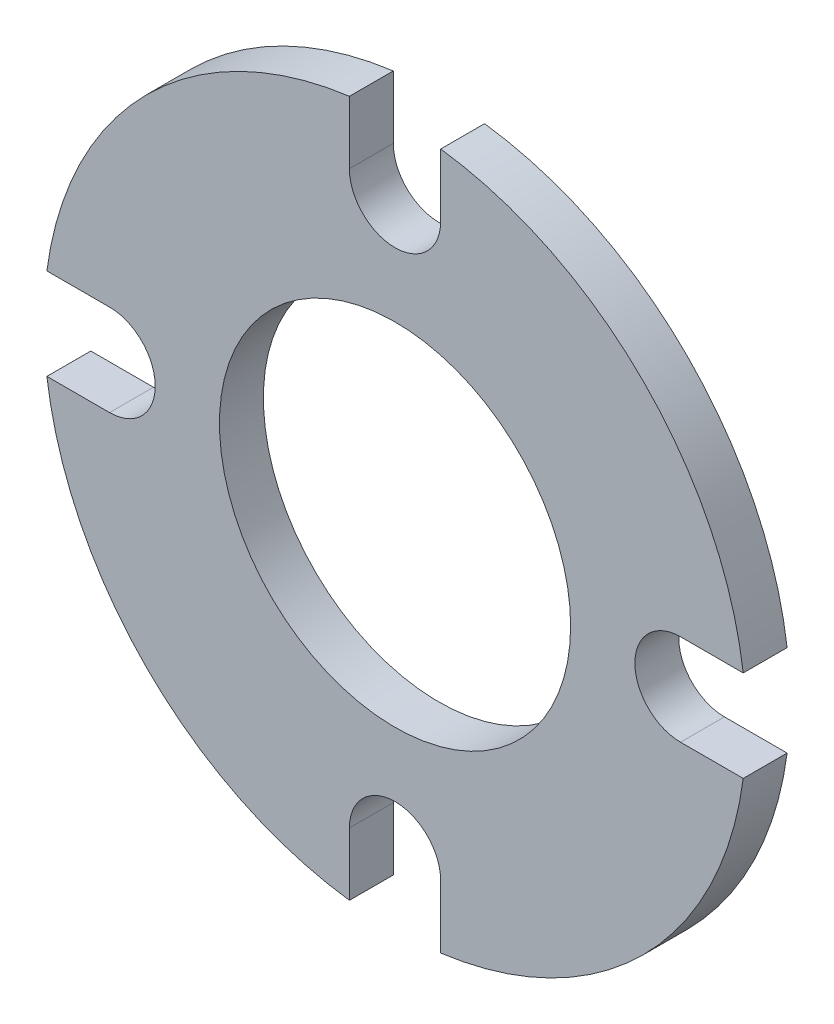
ISO-10303-21;
HEADER;
FILE_DESCRIPTION(('STEP AP214'),'2;1');
FILE_NAME('part.step','',(''),(''),'','','');
FILE_SCHEMA(('AUTOMOTIVE_DESIGN { 1 0 10303 214 1 1 1 1 }'));
ENDSEC;
DATA;
#1=APPLICATION_CONTEXT('core data for automotive mechanical design processes');
#2=APPLICATION_PROTOCOL_DEFINITION('international standard','automotive_design',2000,#1);
#3=PRODUCT_CONTEXT('',#1,'mechanical');
#4=PRODUCT('Part','Part','',(#3));
#5=PRODUCT_RELATED_PRODUCT_CATEGORY('part','',(#4));
#6=PRODUCT_DEFINITION_FORMATION('','',#4);
#7=PRODUCT_DEFINITION_CONTEXT('part definition',#1,'design');
#8=PRODUCT_DEFINITION('design','',#6,#7);
#9=PRODUCT_DEFINITION_SHAPE('','',#8);
#10=(LENGTH_UNIT() NAMED_UNIT(*) SI_UNIT(.MILLI.,.METRE.));
#11=(NAMED_UNIT(*) PLANE_ANGLE_UNIT() SI_UNIT($,.RADIAN.));
#12=(NAMED_UNIT(*) SI_UNIT($,.STERADIAN.) SOLID_ANGLE_UNIT());
#13=UNCERTAINTY_MEASURE_WITH_UNIT(LENGTH_MEASURE(1.E-05),#10,'distance_accuracy_value','');
#14=(GEOMETRIC_REPRESENTATION_CONTEXT(3) GLOBAL_UNCERTAINTY_ASSIGNED_CONTEXT((#13)) GLOBAL_UNIT_ASSIGNED_CONTEXT((#10,
#11,#12)) REPRESENTATION_CONTEXT('',''));
#15=CARTESIAN_POINT('',(0.,0.,0.));
#16=DIRECTION('',(0.,0.,1.));
#17=DIRECTION('',(1.,0.,0.));
#18=AXIS2_PLACEMENT_3D('',#15,#16,#17);
#19=CARTESIAN_POINT('',(-0.813,0.,0.125));
#20=DIRECTION('',(0.,0.,1.));
#21=DIRECTION('',(1.,0.,0.));
#22=AXIS2_PLACEMENT_3D('',#19,#20,#21);
#23=PLANE('',#22);
#24=CARTESIAN_POINT('',(-0.813,0.,0.125));
#25=DIRECTION('',(0.,0.,-1.));
#26=DIRECTION('',(1.,0.,0.));
#27=AXIS2_PLACEMENT_3D('',#24,#25,#26);
#28=CIRCLE('',#27,0.13);
#29=CARTESIAN_POINT('',(-0.813,0.13,0.125));
#30=VERTEX_POINT('',#29);
#31=CARTESIAN_POINT('',(-0.813,-0.13,0.125));
#32=VERTEX_POINT('',#31);
#33=EDGE_CURVE('E213',#30,#32,#28,.T.);
#34=ORIENTED_EDGE('',*,*,#33,.T.);
#35=DIRECTION('',(-1.,0.,0.));
#36=VECTOR('',#35,1.);
#37=CARTESIAN_POINT('',(-0.991513993849809,-0.13,0.125));
#38=LINE('',#37,#36);
#39=CARTESIAN_POINT('',(-0.991513993849809,-0.13,0.125));
#40=VERTEX_POINT('',#39);
#41=EDGE_CURVE('E121',#32,#40,#38,.T.);
#42=ORIENTED_EDGE('',*,*,#41,.T.);
#43=CARTESIAN_POINT('',(0.,0.,0.125));
#44=DIRECTION('',(0.,0.,1.));
#45=DIRECTION('',(1.,0.,0.));
#46=AXIS2_PLACEMENT_3D('',#43,#44,#45);
#47=CIRCLE('',#46,1.);
#48=CARTESIAN_POINT('',(-0.13,-0.991513993849809,0.125));
#49=VERTEX_POINT('',#48);
#50=EDGE_CURVE('E252',#40,#49,#47,.T.);
#51=ORIENTED_EDGE('',*,*,#50,.T.);
#52=DIRECTION('',(0.,1.,0.));
#53=VECTOR('',#52,1.);
#54=CARTESIAN_POINT('',(-0.130000000000008,-0.812999999999999,0.125));
#55=LINE('',#54,#53);
#56=CARTESIAN_POINT('',(-0.130000000000008,-0.812999999999999,0.125));
#57=VERTEX_POINT('',#56);
#58=EDGE_CURVE('E271',#49,#57,#55,.T.);
#59=ORIENTED_EDGE('',*,*,#58,.T.);
#60=CARTESIAN_POINT('',(0.,-0.813,0.125));
#61=DIRECTION('',(0.,0.,-1.));
#62=DIRECTION('',(1.,0.,0.));
#63=AXIS2_PLACEMENT_3D('',#60,#61,#62);
#64=CIRCLE('',#63,0.13);
#65=CARTESIAN_POINT('',(0.129999999999992,-0.813000000000001,0.125));
#66=VERTEX_POINT('',#65);
#67=EDGE_CURVE('E268',#57,#66,#64,.T.);
#68=ORIENTED_EDGE('',*,*,#67,.T.);
#69=DIRECTION('',(0.,-1.,0.));
#70=VECTOR('',#69,1.);
#71=CARTESIAN_POINT('',(0.12999999999999,-0.991513993849811,0.125));
#72=LINE('',#71,#70);
#73=CARTESIAN_POINT('',(0.12999999999999,-0.991513993849811,0.125));
#74=VERTEX_POINT('',#73);
#75=EDGE_CURVE('E270',#66,#74,#72,.T.);
#76=ORIENTED_EDGE('',*,*,#75,.T.);
#77=CARTESIAN_POINT('',(0.,0.,0.125));
#78=DIRECTION('',(0.,0.,1.));
#79=DIRECTION('',(1.,0.,0.));
#80=AXIS2_PLACEMENT_3D('',#77,#78,#79);
#81=CIRCLE('',#80,1.);
#82=CARTESIAN_POINT('',(0.991513993849809,-0.130000000000007,0.125));
#83=VERTEX_POINT('',#82);
#84=EDGE_CURVE('E273',#74,#83,#81,.T.);
#85=ORIENTED_EDGE('',*,*,#84,.T.);
#86=DIRECTION('',(-1.,0.,0.));
#87=VECTOR('',#86,1.);
#88=CARTESIAN_POINT('',(0.812999999999999,-0.130000000000005,0.125));
#89=LINE('',#88,#87);
#90=CARTESIAN_POINT('',(0.812999999999999,-0.130000000000005,0.125));
#91=VERTEX_POINT('',#90);
#92=EDGE_CURVE('E279',#83,#91,#89,.T.);
#93=ORIENTED_EDGE('',*,*,#92,.T.);
#94=CARTESIAN_POINT('',(0.813,0.,0.125));
#95=DIRECTION('',(0.,0.,-1.));
#96=DIRECTION('',(1.,0.,0.));
#97=AXIS2_PLACEMENT_3D('',#94,#95,#96);
#98=CIRCLE('',#97,0.13);
#99=CARTESIAN_POINT('',(0.813000000000001,0.129999999999995,0.125));
#100=VERTEX_POINT('',#99);
#101=EDGE_CURVE('E281',#91,#100,#98,.T.);
#102=ORIENTED_EDGE('',*,*,#101,.T.);
#103=DIRECTION('',(1.,0.,0.));
#104=VECTOR('',#103,1.);
#105=CARTESIAN_POINT('',(0.99151399384981,0.129999999999993,0.125));
#106=LINE('',#105,#104);
#107=CARTESIAN_POINT('',(0.99151399384981,0.129999999999993,0.125));
#108=VERTEX_POINT('',#107);
#109=EDGE_CURVE('E283',#100,#108,#106,.T.);
#110=ORIENTED_EDGE('',*,*,#109,.T.);
#111=CARTESIAN_POINT('',(0.,0.,0.125));
#112=DIRECTION('',(0.,0.,1.));
#113=DIRECTION('',(1.,0.,0.));
#114=AXIS2_PLACEMENT_3D('',#111,#112,#113);
#115=CIRCLE('',#114,1.);
#116=CARTESIAN_POINT('',(0.130000000000003,0.991513993849809,0.125));
#117=VERTEX_POINT('',#116);
#118=EDGE_CURVE('E285',#108,#117,#115,.T.);
#119=ORIENTED_EDGE('',*,*,#118,.T.);
#120=DIRECTION('',(0.,-1.,0.));
#121=VECTOR('',#120,1.);
#122=CARTESIAN_POINT('',(0.130000000000003,0.813,0.125));
#123=LINE('',#122,#121);
#124=CARTESIAN_POINT('',(0.130000000000003,0.813,0.125));
#125=VERTEX_POINT('',#124);
#126=EDGE_CURVE('E287',#117,#125,#123,.T.);
#127=ORIENTED_EDGE('',*,*,#126,.T.);
#128=CARTESIAN_POINT('',(0.,0.813,0.125));
#129=DIRECTION('',(0.,0.,-1.));
#130=DIRECTION('',(1.,0.,0.));
#131=AXIS2_PLACEMENT_3D('',#128,#129,#130);
#132=CIRCLE('',#131,0.13);
#133=CARTESIAN_POINT('',(-0.129999999999998,0.813,0.125));
#134=VERTEX_POINT('',#133);
#135=EDGE_CURVE('E164',#125,#134,#132,.T.);
#136=ORIENTED_EDGE('',*,*,#135,.T.);
#137=DIRECTION('',(0.,1.,0.));
#138=VECTOR('',#137,1.);
#139=CARTESIAN_POINT('',(-0.129999999999997,0.99151399384981,0.125));
#140=LINE('',#139,#138);
#141=CARTESIAN_POINT('',(-0.129999999999997,0.99151399384981,0.125));
#142=VERTEX_POINT('',#141);
#143=EDGE_CURVE('E158',#134,#142,#140,.T.);
#144=ORIENTED_EDGE('',*,*,#143,.T.);
#145=CARTESIAN_POINT('',(0.,0.,0.125));
#146=DIRECTION('',(0.,0.,1.));
#147=DIRECTION('',(1.,0.,0.));
#148=AXIS2_PLACEMENT_3D('',#145,#146,#147);
#149=CIRCLE('',#148,1.);
#150=CARTESIAN_POINT('',(-0.991513993849809,0.13,0.125));
#151=VERTEX_POINT('',#150);
#152=EDGE_CURVE('E162',#142,#151,#149,.T.);
#153=ORIENTED_EDGE('',*,*,#152,.T.);
#154=DIRECTION('',(1.,0.,0.));
#155=VECTOR('',#154,1.);
#156=CARTESIAN_POINT('',(-0.813,0.13,0.125));
#157=LINE('',#156,#155);
#158=EDGE_CURVE('E54',#151,#30,#157,.T.);
#159=ORIENTED_EDGE('',*,*,#158,.T.);
#160=EDGE_LOOP('',(#34,#42,#51,#59,#68,#76,#85,#93,#102,#110,#119,#127,#136,#144,#153,#159));
#161=FACE_BOUND('',#160,.T.);
#162=CARTESIAN_POINT('',(0.,0.,0.125));
#163=DIRECTION('',(0.,0.,1.));
#164=DIRECTION('',(1.,0.,0.));
#165=AXIS2_PLACEMENT_3D('',#162,#163,#164);
#166=CIRCLE('',#165,0.5);
#167=CARTESIAN_POINT('',(0.5,0.,0.125));
#168=VERTEX_POINT('',#167);
#169=EDGE_CURVE('E186',#168,#168,#166,.T.);
#170=ORIENTED_EDGE('',*,*,#169,.F.);
#171=EDGE_LOOP('',(#170));
#172=FACE_BOUND('',#171,.T.);
#173=ADVANCED_FACE('F37',(#161,#172),#23,.T.);
#174=CARTESIAN_POINT('',(-0.813,0.,0.));
#175=DIRECTION('',(0.,0.,1.));
#176=DIRECTION('',(1.,0.,0.));
#177=AXIS2_PLACEMENT_3D('',#174,#175,#176);
#178=PLANE('',#177);
#179=CARTESIAN_POINT('',(-0.813,0.,0.));
#180=DIRECTION('',(0.,0.,-1.));
#181=DIRECTION('',(1.,0.,0.));
#182=AXIS2_PLACEMENT_3D('',#179,#180,#181);
#183=CIRCLE('',#182,0.13);
#184=CARTESIAN_POINT('',(-0.813,0.13,0.));
#185=VERTEX_POINT('',#184);
#186=CARTESIAN_POINT('',(-0.813,-0.13,0.));
#187=VERTEX_POINT('',#186);
#188=EDGE_CURVE('E182',#185,#187,#183,.T.);
#189=ORIENTED_EDGE('',*,*,#188,.F.);
#190=DIRECTION('',(1.,0.,0.));
#191=VECTOR('',#190,1.);
#192=CARTESIAN_POINT('',(-0.813,0.13,0.));
#193=LINE('',#192,#191);
#194=CARTESIAN_POINT('',(-0.991513993849809,0.13,0.));
#195=VERTEX_POINT('',#194);
#196=EDGE_CURVE('E113',#195,#185,#193,.T.);
#197=ORIENTED_EDGE('',*,*,#196,.F.);
#198=CARTESIAN_POINT('',(0.,0.,0.));
#199=DIRECTION('',(0.,0.,1.));
#200=DIRECTION('',(1.,0.,0.));
#201=AXIS2_PLACEMENT_3D('',#198,#199,#200);
#202=CIRCLE('',#201,1.);
#203=CARTESIAN_POINT('',(-0.129999999999997,0.99151399384981,0.));
#204=VERTEX_POINT('',#203);
#205=EDGE_CURVE('E107',#204,#195,#202,.T.);
#206=ORIENTED_EDGE('',*,*,#205,.F.);
#207=DIRECTION('',(0.,1.,0.));
#208=VECTOR('',#207,1.);
#209=CARTESIAN_POINT('',(-0.129999999999997,0.99151399384981,0.));
#210=LINE('',#209,#208);
#211=CARTESIAN_POINT('',(-0.129999999999998,0.813,0.));
#212=VERTEX_POINT('',#211);
#213=EDGE_CURVE('E172',#212,#204,#210,.T.);
#214=ORIENTED_EDGE('',*,*,#213,.F.);
#215=CARTESIAN_POINT('',(0.,0.813,0.));
#216=DIRECTION('',(0.,0.,-1.));
#217=DIRECTION('',(1.,0.,0.));
#218=AXIS2_PLACEMENT_3D('',#215,#216,#217);
#219=CIRCLE('',#218,0.13);
#220=CARTESIAN_POINT('',(0.130000000000003,0.813,0.));
#221=VERTEX_POINT('',#220);
#222=EDGE_CURVE('E208',#221,#212,#219,.T.);
#223=ORIENTED_EDGE('',*,*,#222,.F.);
#224=DIRECTION('',(0.,-1.,0.));
#225=VECTOR('',#224,1.);
#226=CARTESIAN_POINT('',(0.130000000000003,0.813,0.));
#227=LINE('',#226,#225);
#228=CARTESIAN_POINT('',(0.130000000000003,0.991513993849809,0.));
#229=VERTEX_POINT('',#228);
#230=EDGE_CURVE('E206',#229,#221,#227,.T.);
#231=ORIENTED_EDGE('',*,*,#230,.F.);
#232=CARTESIAN_POINT('',(0.,0.,0.));
#233=DIRECTION('',(0.,0.,1.));
#234=DIRECTION('',(1.,0.,0.));
#235=AXIS2_PLACEMENT_3D('',#232,#233,#234);
#236=CIRCLE('',#235,1.);
#237=CARTESIAN_POINT('',(0.99151399384981,0.129999999999993,0.));
#238=VERTEX_POINT('',#237);
#239=EDGE_CURVE('E204',#238,#229,#236,.T.);
#240=ORIENTED_EDGE('',*,*,#239,.F.);
#241=DIRECTION('',(1.,0.,0.));
#242=VECTOR('',#241,1.);
#243=CARTESIAN_POINT('',(0.99151399384981,0.129999999999993,0.));
#244=LINE('',#243,#242);
#245=CARTESIAN_POINT('',(0.813000000000001,0.129999999999995,0.));
#246=VERTEX_POINT('',#245);
#247=EDGE_CURVE('E202',#246,#238,#244,.T.);
#248=ORIENTED_EDGE('',*,*,#247,.F.);
#249=CARTESIAN_POINT('',(0.813,0.,0.));
#250=DIRECTION('',(0.,0.,-1.));
#251=DIRECTION('',(1.,0.,0.));
#252=AXIS2_PLACEMENT_3D('',#249,#250,#251);
#253=CIRCLE('',#252,0.13);
#254=CARTESIAN_POINT('',(0.812999999999999,-0.130000000000005,0.));
#255=VERTEX_POINT('',#254);
#256=EDGE_CURVE('E200',#255,#246,#253,.T.);
#257=ORIENTED_EDGE('',*,*,#256,.F.);
#258=DIRECTION('',(-1.,0.,0.));
#259=VECTOR('',#258,1.);
#260=CARTESIAN_POINT('',(0.812999999999999,-0.130000000000005,0.));
#261=LINE('',#260,#259);
#262=CARTESIAN_POINT('',(0.991513993849809,-0.130000000000007,0.));
#263=VERTEX_POINT('',#262);
#264=EDGE_CURVE('E198',#263,#255,#261,.T.);
#265=ORIENTED_EDGE('',*,*,#264,.F.);
#266=CARTESIAN_POINT('',(0.,0.,0.));
#267=DIRECTION('',(0.,0.,1.));
#268=DIRECTION('',(1.,0.,0.));
#269=AXIS2_PLACEMENT_3D('',#266,#267,#268);
#270=CIRCLE('',#269,1.);
#271=CARTESIAN_POINT('',(0.12999999999999,-0.991513993849811,0.));
#272=VERTEX_POINT('',#271);
#273=EDGE_CURVE('E196',#272,#263,#270,.T.);
#274=ORIENTED_EDGE('',*,*,#273,.F.);
#275=DIRECTION('',(0.,-1.,0.));
#276=VECTOR('',#275,1.);
#277=CARTESIAN_POINT('',(0.12999999999999,-0.991513993849811,0.));
#278=LINE('',#277,#276);
#279=CARTESIAN_POINT('',(0.129999999999992,-0.813000000000001,0.));
#280=VERTEX_POINT('',#279);
#281=EDGE_CURVE('E194',#280,#272,#278,.T.);
#282=ORIENTED_EDGE('',*,*,#281,.F.);
#283=CARTESIAN_POINT('',(0.,-0.813,0.));
#284=DIRECTION('',(0.,0.,-1.));
#285=DIRECTION('',(1.,0.,0.));
#286=AXIS2_PLACEMENT_3D('',#283,#284,#285);
#287=CIRCLE('',#286,0.13);
#288=CARTESIAN_POINT('',(-0.130000000000008,-0.812999999999999,0.));
#289=VERTEX_POINT('',#288);
#290=EDGE_CURVE('E192',#289,#280,#287,.T.);
#291=ORIENTED_EDGE('',*,*,#290,.F.);
#292=DIRECTION('',(0.,1.,0.));
#293=VECTOR('',#292,1.);
#294=CARTESIAN_POINT('',(-0.130000000000008,-0.812999999999999,0.));
#295=LINE('',#294,#293);
#296=CARTESIAN_POINT('',(-0.13,-0.991513993849809,0.));
#297=VERTEX_POINT('',#296);
#298=EDGE_CURVE('E190',#297,#289,#295,.T.);
#299=ORIENTED_EDGE('',*,*,#298,.F.);
#300=CARTESIAN_POINT('',(0.,0.,0.));
#301=DIRECTION('',(0.,0.,1.));
#302=DIRECTION('',(1.,0.,0.));
#303=AXIS2_PLACEMENT_3D('',#300,#301,#302);
#304=CIRCLE('',#303,1.);
#305=CARTESIAN_POINT('',(-0.991513993849809,-0.13,0.));
#306=VERTEX_POINT('',#305);
#307=EDGE_CURVE('E188',#306,#297,#304,.T.);
#308=ORIENTED_EDGE('',*,*,#307,.F.);
#309=DIRECTION('',(-1.,0.,0.));
#310=VECTOR('',#309,1.);
#311=CARTESIAN_POINT('',(-0.991513993849809,-0.13,0.));
#312=LINE('',#311,#310);
#313=EDGE_CURVE('E185',#187,#306,#312,.T.);
#314=ORIENTED_EDGE('',*,*,#313,.F.);
#315=EDGE_LOOP('',(#189,#197,#206,#214,#223,#231,#240,#248,#257,#265,#274,#282,#291,#299,#308,#314));
#316=FACE_BOUND('',#315,.T.);
#317=CARTESIAN_POINT('',(0.,0.,0.));
#318=DIRECTION('',(0.,0.,1.));
#319=DIRECTION('',(1.,0.,0.));
#320=AXIS2_PLACEMENT_3D('',#317,#318,#319);
#321=CIRCLE('',#320,0.5);
#322=CARTESIAN_POINT('',(0.5,0.,0.));
#323=VERTEX_POINT('',#322);
#324=EDGE_CURVE('E524',#323,#323,#321,.T.);
#325=ORIENTED_EDGE('',*,*,#324,.T.);
#326=EDGE_LOOP('',(#325));
#327=FACE_BOUND('',#326,.T.);
#328=ADVANCED_FACE('F256',(#316,#327),#178,.F.);
#329=CARTESIAN_POINT('',(-0.813,0.,0.125));
#330=DIRECTION('',(0.,0.,-1.));
#331=DIRECTION('',(-1.,0.,0.));
#332=AXIS2_PLACEMENT_3D('',#329,#330,#331);
#333=CYLINDRICAL_SURFACE('',#332,0.13);
#334=ORIENTED_EDGE('',*,*,#188,.T.);
#335=DIRECTION('',(0.,0.,-1.));
#336=VECTOR('',#335,1.);
#337=CARTESIAN_POINT('',(-0.813,-0.13,0.125));
#338=LINE('',#337,#336);
#339=EDGE_CURVE('E11',#32,#187,#338,.T.);
#340=ORIENTED_EDGE('',*,*,#339,.F.);
#341=ORIENTED_EDGE('',*,*,#33,.F.);
#342=DIRECTION('',(0.,0.,-1.));
#343=VECTOR('',#342,1.);
#344=CARTESIAN_POINT('',(-0.813,0.13,0.125));
#345=LINE('',#344,#343);
#346=EDGE_CURVE('E178',#30,#185,#345,.T.);
#347=ORIENTED_EDGE('',*,*,#346,.T.);
#348=EDGE_LOOP('',(#334,#340,#341,#347));
#349=FACE_BOUND('',#348,.T.);
#350=ADVANCED_FACE('F39',(#349),#333,.F.);
#351=CARTESIAN_POINT('',(-0.991513993849809,-0.13,0.125));
#352=DIRECTION('',(0.,-1.,0.));
#353=DIRECTION('',(0.,0.,-1.));
#354=AXIS2_PLACEMENT_3D('',#351,#352,#353);
#355=PLANE('',#354);
#356=ORIENTED_EDGE('',*,*,#313,.T.);
#357=DIRECTION('',(0.,0.,-1.));
#358=VECTOR('',#357,1.);
#359=CARTESIAN_POINT('',(-0.991513993849809,-0.13,0.125));
#360=LINE('',#359,#358);
#361=EDGE_CURVE('E46',#40,#306,#360,.T.);
#362=ORIENTED_EDGE('',*,*,#361,.F.);
#363=ORIENTED_EDGE('',*,*,#41,.F.);
#364=ORIENTED_EDGE('',*,*,#339,.T.);
#365=EDGE_LOOP('',(#356,#362,#363,#364));
#366=FACE_BOUND('',#365,.T.);
#367=ADVANCED_FACE('F321',(#366),#355,.F.);
#368=CARTESIAN_POINT('',(0.,0.,0.125));
#369=DIRECTION('',(0.,0.,-1.));
#370=DIRECTION('',(-1.,0.,0.));
#371=AXIS2_PLACEMENT_3D('',#368,#369,#370);
#372=CYLINDRICAL_SURFACE('',#371,1.);
#373=ORIENTED_EDGE('',*,*,#307,.T.);
#374=DIRECTION('',(0.,0.,-1.));
#375=VECTOR('',#374,1.);
#376=CARTESIAN_POINT('',(-0.13,-0.991513993849809,0.125));
#377=LINE('',#376,#375);
#378=EDGE_CURVE('E244',#49,#297,#377,.T.);
#379=ORIENTED_EDGE('',*,*,#378,.F.);
#380=ORIENTED_EDGE('',*,*,#50,.F.);
#381=ORIENTED_EDGE('',*,*,#361,.T.);
#382=EDGE_LOOP('',(#373,#379,#380,#381));
#383=FACE_BOUND('',#382,.T.);
#384=ADVANCED_FACE('F250',(#383),#372,.T.);
#385=CARTESIAN_POINT('',(-0.130000000000008,-0.812999999999999,0.125));
#386=DIRECTION('',(-1.,0.,0.));
#387=DIRECTION('',(0.,-1.,0.));
#388=AXIS2_PLACEMENT_3D('',#385,#386,#387);
#389=PLANE('',#388);
#390=ORIENTED_EDGE('',*,*,#298,.T.);
#391=DIRECTION('',(0.,0.,-1.));
#392=VECTOR('',#391,1.);
#393=CARTESIAN_POINT('',(-0.130000000000008,-0.812999999999999,0.125));
#394=LINE('',#393,#392);
#395=EDGE_CURVE('E241',#57,#289,#394,.T.);
#396=ORIENTED_EDGE('',*,*,#395,.F.);
#397=ORIENTED_EDGE('',*,*,#58,.F.);
#398=ORIENTED_EDGE('',*,*,#378,.T.);
#399=EDGE_LOOP('',(#390,#396,#397,#398));
#400=FACE_BOUND('',#399,.T.);
#401=ADVANCED_FACE('F262',(#400),#389,.F.);
#402=CARTESIAN_POINT('',(0.,-0.813,0.125));
#403=DIRECTION('',(0.,0.,-1.));
#404=DIRECTION('',(-1.,0.,0.));
#405=AXIS2_PLACEMENT_3D('',#402,#403,#404);
#406=CYLINDRICAL_SURFACE('',#405,0.13);
#407=ORIENTED_EDGE('',*,*,#290,.T.);
#408=DIRECTION('',(0.,0.,-1.));
#409=VECTOR('',#408,1.);
#410=CARTESIAN_POINT('',(0.129999999999992,-0.813000000000001,0.125));
#411=LINE('',#410,#409);
#412=EDGE_CURVE('E238',#66,#280,#411,.T.);
#413=ORIENTED_EDGE('',*,*,#412,.F.);
#414=ORIENTED_EDGE('',*,*,#67,.F.);
#415=ORIENTED_EDGE('',*,*,#395,.T.);
#416=EDGE_LOOP('',(#407,#413,#414,#415));
#417=FACE_BOUND('',#416,.T.);
#418=ADVANCED_FACE('F266',(#417),#406,.F.);
#419=CARTESIAN_POINT('',(0.12999999999999,-0.991513993849811,0.125));
#420=DIRECTION('',(1.,0.,0.));
#421=DIRECTION('',(0.,1.,0.));
#422=AXIS2_PLACEMENT_3D('',#419,#420,#421);
#423=PLANE('',#422);
#424=ORIENTED_EDGE('',*,*,#281,.T.);
#425=DIRECTION('',(0.,0.,-1.));
#426=VECTOR('',#425,1.);
#427=CARTESIAN_POINT('',(0.12999999999999,-0.991513993849811,0.125));
#428=LINE('',#427,#426);
#429=EDGE_CURVE('E235',#74,#272,#428,.T.);
#430=ORIENTED_EDGE('',*,*,#429,.F.);
#431=ORIENTED_EDGE('',*,*,#75,.F.);
#432=ORIENTED_EDGE('',*,*,#412,.T.);
#433=EDGE_LOOP('',(#424,#430,#431,#432));
#434=FACE_BOUND('',#433,.T.);
#435=ADVANCED_FACE('F334',(#434),#423,.F.);
#436=CARTESIAN_POINT('',(0.,0.,0.125));
#437=DIRECTION('',(0.,0.,-1.));
#438=DIRECTION('',(-1.,0.,0.));
#439=AXIS2_PLACEMENT_3D('',#436,#437,#438);
#440=CYLINDRICAL_SURFACE('',#439,1.);
#441=ORIENTED_EDGE('',*,*,#273,.T.);
#442=DIRECTION('',(0.,0.,-1.));
#443=VECTOR('',#442,1.);
#444=CARTESIAN_POINT('',(0.991513993849809,-0.130000000000007,0.125));
#445=LINE('',#444,#443);
#446=EDGE_CURVE('E232',#83,#263,#445,.T.);
#447=ORIENTED_EDGE('',*,*,#446,.F.);
#448=ORIENTED_EDGE('',*,*,#84,.F.);
#449=ORIENTED_EDGE('',*,*,#429,.T.);
#450=EDGE_LOOP('',(#441,#447,#448,#449));
#451=FACE_BOUND('',#450,.T.);
#452=ADVANCED_FACE('F337',(#451),#440,.T.);
#453=CARTESIAN_POINT('',(0.812999999999999,-0.130000000000005,0.125));
#454=DIRECTION('',(0.,-1.,0.));
#455=DIRECTION('',(1.,0.,0.));
#456=AXIS2_PLACEMENT_3D('',#453,#454,#455);
#457=PLANE('',#456);
#458=ORIENTED_EDGE('',*,*,#264,.T.);
#459=DIRECTION('',(0.,0.,-1.));
#460=VECTOR('',#459,1.);
#461=CARTESIAN_POINT('',(0.812999999999999,-0.130000000000005,0.125));
#462=LINE('',#461,#460);
#463=EDGE_CURVE('E229',#91,#255,#462,.T.);
#464=ORIENTED_EDGE('',*,*,#463,.F.);
#465=ORIENTED_EDGE('',*,*,#92,.F.);
#466=ORIENTED_EDGE('',*,*,#446,.T.);
#467=EDGE_LOOP('',(#458,#464,#465,#466));
#468=FACE_BOUND('',#467,.T.);
#469=ADVANCED_FACE('F341',(#468),#457,.F.);
#470=CARTESIAN_POINT('',(0.813,0.,0.125));
#471=DIRECTION('',(0.,0.,-1.));
#472=DIRECTION('',(-1.,0.,0.));
#473=AXIS2_PLACEMENT_3D('',#470,#471,#472);
#474=CYLINDRICAL_SURFACE('',#473,0.13);
#475=ORIENTED_EDGE('',*,*,#256,.T.);
#476=DIRECTION('',(0.,0.,-1.));
#477=VECTOR('',#476,1.);
#478=CARTESIAN_POINT('',(0.813000000000001,0.129999999999995,0.125));
#479=LINE('',#478,#477);
#480=EDGE_CURVE('E226',#100,#246,#479,.T.);
#481=ORIENTED_EDGE('',*,*,#480,.F.);
#482=ORIENTED_EDGE('',*,*,#101,.F.);
#483=ORIENTED_EDGE('',*,*,#463,.T.);
#484=EDGE_LOOP('',(#475,#481,#482,#483));
#485=FACE_BOUND('',#484,.T.);
#486=ADVANCED_FACE('F345',(#485),#474,.F.);
#487=CARTESIAN_POINT('',(0.99151399384981,0.129999999999993,0.125));
#488=DIRECTION('',(0.,1.,0.));
#489=DIRECTION('',(-1.,0.,0.));
#490=AXIS2_PLACEMENT_3D('',#487,#488,#489);
#491=PLANE('',#490);
#492=ORIENTED_EDGE('',*,*,#247,.T.);
#493=DIRECTION('',(0.,0.,-1.));
#494=VECTOR('',#493,1.);
#495=CARTESIAN_POINT('',(0.99151399384981,0.129999999999993,0.125));
#496=LINE('',#495,#494);
#497=EDGE_CURVE('E223',#108,#238,#496,.T.);
#498=ORIENTED_EDGE('',*,*,#497,.F.);
#499=ORIENTED_EDGE('',*,*,#109,.F.);
#500=ORIENTED_EDGE('',*,*,#480,.T.);
#501=EDGE_LOOP('',(#492,#498,#499,#500));
#502=FACE_BOUND('',#501,.T.);
#503=ADVANCED_FACE('F349',(#502),#491,.F.);
#504=CARTESIAN_POINT('',(0.,0.,0.125));
#505=DIRECTION('',(0.,0.,-1.));
#506=DIRECTION('',(-1.,0.,0.));
#507=AXIS2_PLACEMENT_3D('',#504,#505,#506);
#508=CYLINDRICAL_SURFACE('',#507,1.);
#509=ORIENTED_EDGE('',*,*,#239,.T.);
#510=DIRECTION('',(0.,0.,-1.));
#511=VECTOR('',#510,1.);
#512=CARTESIAN_POINT('',(0.130000000000003,0.991513993849809,0.125));
#513=LINE('',#512,#511);
#514=EDGE_CURVE('E220',#117,#229,#513,.T.);
#515=ORIENTED_EDGE('',*,*,#514,.F.);
#516=ORIENTED_EDGE('',*,*,#118,.F.);
#517=ORIENTED_EDGE('',*,*,#497,.T.);
#518=EDGE_LOOP('',(#509,#515,#516,#517));
#519=FACE_BOUND('',#518,.T.);
#520=ADVANCED_FACE('F353',(#519),#508,.T.);
#521=CARTESIAN_POINT('',(0.130000000000003,0.813,0.125));
#522=DIRECTION('',(1.,0.,0.));
#523=DIRECTION('',(0.,1.,0.));
#524=AXIS2_PLACEMENT_3D('',#521,#522,#523);
#525=PLANE('',#524);
#526=ORIENTED_EDGE('',*,*,#230,.T.);
#527=DIRECTION('',(0.,0.,-1.));
#528=VECTOR('',#527,1.);
#529=CARTESIAN_POINT('',(0.130000000000003,0.813,0.125));
#530=LINE('',#529,#528);
#531=EDGE_CURVE('E217',#125,#221,#530,.T.);
#532=ORIENTED_EDGE('',*,*,#531,.F.);
#533=ORIENTED_EDGE('',*,*,#126,.F.);
#534=ORIENTED_EDGE('',*,*,#514,.T.);
#535=EDGE_LOOP('',(#526,#532,#533,#534));
#536=FACE_BOUND('',#535,.T.);
#537=ADVANCED_FACE('F293',(#536),#525,.F.);
#538=CARTESIAN_POINT('',(0.,0.813,0.125));
#539=DIRECTION('',(0.,0.,-1.));
#540=DIRECTION('',(-1.,0.,0.));
#541=AXIS2_PLACEMENT_3D('',#538,#539,#540);
#542=CYLINDRICAL_SURFACE('',#541,0.13);
#543=ORIENTED_EDGE('',*,*,#222,.T.);
#544=DIRECTION('',(0.,0.,-1.));
#545=VECTOR('',#544,1.);
#546=CARTESIAN_POINT('',(-0.129999999999998,0.813,0.125));
#547=LINE('',#546,#545);
#548=EDGE_CURVE('E173',#134,#212,#547,.T.);
#549=ORIENTED_EDGE('',*,*,#548,.F.);
#550=ORIENTED_EDGE('',*,*,#135,.F.);
#551=ORIENTED_EDGE('',*,*,#531,.T.);
#552=EDGE_LOOP('',(#543,#549,#550,#551));
#553=FACE_BOUND('',#552,.T.);
#554=ADVANCED_FACE('F297',(#553),#542,.F.);
#555=CARTESIAN_POINT('',(-0.129999999999997,0.99151399384981,0.125));
#556=DIRECTION('',(-1.,0.,0.));
#557=DIRECTION('',(0.,-1.,0.));
#558=AXIS2_PLACEMENT_3D('',#555,#556,#557);
#559=PLANE('',#558);
#560=ORIENTED_EDGE('',*,*,#213,.T.);
#561=DIRECTION('',(0.,0.,-1.));
#562=VECTOR('',#561,1.);
#563=CARTESIAN_POINT('',(-0.129999999999997,0.99151399384981,0.125));
#564=LINE('',#563,#562);
#565=EDGE_CURVE('E169',#142,#204,#564,.T.);
#566=ORIENTED_EDGE('',*,*,#565,.F.);
#567=ORIENTED_EDGE('',*,*,#143,.F.);
#568=ORIENTED_EDGE('',*,*,#548,.T.);
#569=EDGE_LOOP('',(#560,#566,#567,#568));
#570=FACE_BOUND('',#569,.T.);
#571=ADVANCED_FACE('F170',(#570),#559,.F.);
#572=CARTESIAN_POINT('',(0.,0.,0.125));
#573=DIRECTION('',(0.,0.,-1.));
#574=DIRECTION('',(-1.,0.,0.));
#575=AXIS2_PLACEMENT_3D('',#572,#573,#574);
#576=CYLINDRICAL_SURFACE('',#575,1.);
#577=ORIENTED_EDGE('',*,*,#205,.T.);
#578=DIRECTION('',(0.,0.,-1.));
#579=VECTOR('',#578,1.);
#580=CARTESIAN_POINT('',(-0.991513993849809,0.13,0.125));
#581=LINE('',#580,#579);
#582=EDGE_CURVE('E174',#151,#195,#581,.T.);
#583=ORIENTED_EDGE('',*,*,#582,.F.);
#584=ORIENTED_EDGE('',*,*,#152,.F.);
#585=ORIENTED_EDGE('',*,*,#565,.T.);
#586=EDGE_LOOP('',(#577,#583,#584,#585));
#587=FACE_BOUND('',#586,.T.);
#588=ADVANCED_FACE('F176',(#587),#576,.T.);
#589=CARTESIAN_POINT('',(-0.813,0.13,0.125));
#590=DIRECTION('',(0.,1.,0.));
#591=DIRECTION('',(-1.,0.,0.));
#592=AXIS2_PLACEMENT_3D('',#589,#590,#591);
#593=PLANE('',#592);
#594=ORIENTED_EDGE('',*,*,#196,.T.);
#595=ORIENTED_EDGE('',*,*,#346,.F.);
#596=ORIENTED_EDGE('',*,*,#158,.F.);
#597=ORIENTED_EDGE('',*,*,#582,.T.);
#598=EDGE_LOOP('',(#594,#595,#596,#597));
#599=FACE_BOUND('',#598,.T.);
#600=ADVANCED_FACE('F301',(#599),#593,.F.);
#601=CARTESIAN_POINT('',(0.,0.,0.125));
#602=DIRECTION('',(0.,0.,-1.));
#603=DIRECTION('',(-1.,0.,0.));
#604=AXIS2_PLACEMENT_3D('',#601,#602,#603);
#605=CYLINDRICAL_SURFACE('',#604,0.5);
#606=ORIENTED_EDGE('',*,*,#169,.T.);
#607=EDGE_LOOP('',(#606));
#608=FACE_BOUND('',#607,.T.);
#609=ORIENTED_EDGE('',*,*,#324,.F.);
#610=EDGE_LOOP('',(#609));
#611=FACE_BOUND('',#610,.T.);
#612=ADVANCED_FACE('F303',(#608,#611),#605,.F.);
#613=CLOSED_SHELL('',(#173,#328,#350,#367,#384,#401,#418,#435,#452,#469,#486,#503,#520,#537,
#554,#571,#588,#600,#612));
#614=MANIFOLD_SOLID_BREP('B2',#613);
#615=ADVANCED_BREP_SHAPE_REPRESENTATION('',(#18,#614),#14);
#616=SHAPE_DEFINITION_REPRESENTATION(#9,#615);
ENDSEC;
END-ISO-10303-21;
